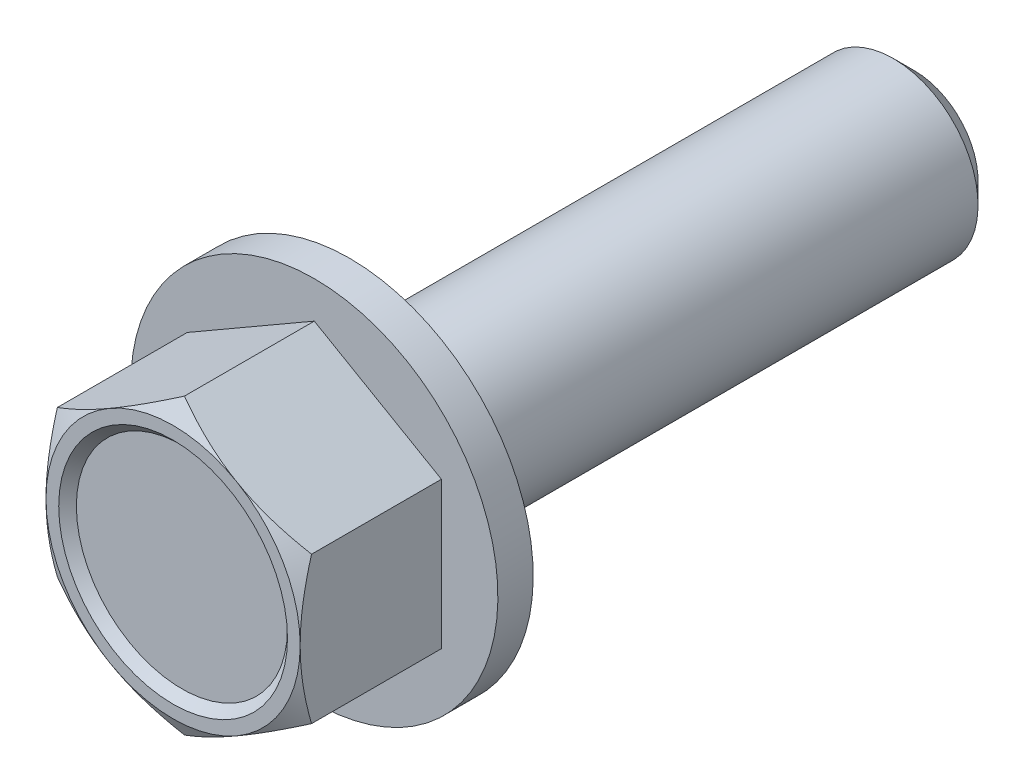
ISO-10303-21;
HEADER;
FILE_DESCRIPTION(('STEP AP214'),'2;1');
FILE_NAME('part.step','',(''),(''),'','','');
FILE_SCHEMA(('AUTOMOTIVE_DESIGN { 1 0 10303 214 1 1 1 1 }'));
ENDSEC;
DATA;
#1=APPLICATION_CONTEXT('core data for automotive mechanical design processes');
#2=APPLICATION_PROTOCOL_DEFINITION('international standard','automotive_design',2000,#1);
#3=PRODUCT_CONTEXT('',#1,'mechanical');
#4=PRODUCT('Part','Part','',(#3));
#5=PRODUCT_RELATED_PRODUCT_CATEGORY('part','',(#4));
#6=PRODUCT_DEFINITION_FORMATION('','',#4);
#7=PRODUCT_DEFINITION_CONTEXT('part definition',#1,'design');
#8=PRODUCT_DEFINITION('design','',#6,#7);
#9=PRODUCT_DEFINITION_SHAPE('','',#8);
#10=(LENGTH_UNIT() NAMED_UNIT(*) SI_UNIT(.MILLI.,.METRE.));
#11=(NAMED_UNIT(*) PLANE_ANGLE_UNIT() SI_UNIT($,.RADIAN.));
#12=(NAMED_UNIT(*) SI_UNIT($,.STERADIAN.) SOLID_ANGLE_UNIT());
#13=UNCERTAINTY_MEASURE_WITH_UNIT(LENGTH_MEASURE(1.E-05),#10,'distance_accuracy_value','');
#14=(GEOMETRIC_REPRESENTATION_CONTEXT(3) GLOBAL_UNCERTAINTY_ASSIGNED_CONTEXT((#13)) GLOBAL_UNIT_ASSIGNED_CONTEXT((#10,
#11,#12)) REPRESENTATION_CONTEXT('',''));
#15=CARTESIAN_POINT('',(0.,0.,0.));
#16=DIRECTION('',(0.,0.,1.));
#17=DIRECTION('',(1.,0.,0.));
#18=AXIS2_PLACEMENT_3D('',#15,#16,#17);
#19=CARTESIAN_POINT('',(7.14375,-4.12444598552339,-29.7620167472272));
#20=DIRECTION('',(1.,0.,0.));
#21=DIRECTION('',(0.,0.,-1.));
#22=AXIS2_PLACEMENT_3D('',#19,#20,#21);
#23=PLANE('',#22);
#24=DIRECTION('',(0.,0.,1.));
#25=VECTOR('',#24,1.);
#26=CARTESIAN_POINT('',(7.14375,4.12444598552339,-29.7620167472272));
#27=LINE('',#26,#25);
#28=CARTESIAN_POINT('',(7.14375,4.12444598552339,-7.9375));
#29=VERTEX_POINT('',#28);
#30=CARTESIAN_POINT('',(7.14375,4.12444598552339,-0.638054014476607));
#31=VERTEX_POINT('',#30);
#32=EDGE_CURVE('E130',#29,#31,#27,.T.);
#33=ORIENTED_EDGE('',*,*,#32,.T.);
#34=CARTESIAN_POINT('',(7.14375,-11.1264821663031,-3.50950819868023));
#35=CARTESIAN_POINT('',(7.14375,-10.8139653368023,-3.35771826747608));
#36=CARTESIAN_POINT('',(7.14375,-10.5007360070904,-3.20737041175011));
#37=CARTESIAN_POINT('',(7.14375,-9.87247341175507,-2.91036930424403));
#38=CARTESIAN_POINT('',(7.14375,-9.55743987513636,-2.76371662635213));
#39=CARTESIAN_POINT('',(7.14375,-8.92359078284582,-2.474189273156));
#40=CARTESIAN_POINT('',(7.14375,-8.60476400473929,-2.33133908243073));
#41=CARTESIAN_POINT('',(7.14375,-7.9645901440533,-2.05142432969127));
#42=CARTESIAN_POINT('',(7.14375,-7.64324318024328,-1.91435949694891));
#43=CARTESIAN_POINT('',(7.14375,-6.98716875317179,-1.6432658754563));
#44=CARTESIAN_POINT('',(7.14375,-6.65234243288806,-1.50947502070524));
#45=CARTESIAN_POINT('',(7.14375,-5.97879168628792,-1.25190405211195));
#46=CARTESIAN_POINT('',(7.14375,-5.64006683029124,-1.12812505404059));
#47=CARTESIAN_POINT('',(7.14375,-4.95879364772962,-0.893791111508422));
#48=CARTESIAN_POINT('',(7.14375,-4.61625446733773,-0.783209860013388));
#49=CARTESIAN_POINT('',(7.14375,-3.92627616557254,-0.578785846429196));
#50=CARTESIAN_POINT('',(7.14375,-3.57883860795286,-0.484937867389285));
#51=CARTESIAN_POINT('',(7.14375,-2.88064126074926,-0.318932739620268));
#52=CARTESIAN_POINT('',(7.14375,-2.5299091116702,-0.246662460359437));
#53=CARTESIAN_POINT('',(7.14375,-2.00058036472825,-0.157568562477359));
#54=CARTESIAN_POINT('',(7.14375,-1.82358702993423,-0.131088053273357));
#55=CARTESIAN_POINT('',(7.14375,-1.46870447103796,-0.0850822824522652));
#56=CARTESIAN_POINT('',(7.14375,-1.29081533532589,-0.0655563477434251));
#57=CARTESIAN_POINT('',(7.14375,-0.936724957060508,-0.0340961976423995));
#58=CARTESIAN_POINT('',(7.14375,-0.760532329416691,-0.0220654101749404));
#59=CARTESIAN_POINT('',(7.14375,-0.40779607194931,-0.00546792409180287));
#60=CARTESIAN_POINT('',(7.14375,-0.231252448081633,-0.000901099887896732));
#61=CARTESIAN_POINT('',(7.14375,0.12187286025024,0.000659376128433967));
#62=CARTESIAN_POINT('',(7.14375,0.298454545369517,-0.00234711490423107));
#63=CARTESIAN_POINT('',(7.14375,0.651332924181608,-0.0158594071837309));
#64=CARTESIAN_POINT('',(7.14375,0.827629603556379,-0.0263655741401726));
#65=CARTESIAN_POINT('',(7.14375,1.24971850742382,-0.0602738892040787));
#66=CARTESIAN_POINT('',(7.14375,1.49523806911308,-0.0871447893509359));
#67=CARTESIAN_POINT('',(7.14375,1.98447603489236,-0.153978286224434));
#68=CARTESIAN_POINT('',(7.14375,2.22819419698766,-0.193942610334252));
#69=CARTESIAN_POINT('',(7.14375,2.95634044363797,-0.331357740941859));
#70=CARTESIAN_POINT('',(7.14375,3.43751087738919,-0.446308001197388));
#71=CARTESIAN_POINT('',(7.14375,4.15738573166842,-0.645993240802331));
#72=CARTESIAN_POINT('',(7.14375,4.39980939898406,-0.718092674680191));
#73=CARTESIAN_POINT('',(7.14375,4.88230108226118,-0.869854806642564));
#74=CARTESIAN_POINT('',(7.14375,5.12236907963036,-0.949517564368237));
#75=CARTESIAN_POINT('',(7.14375,5.60022924677041,-1.11512156257428));
#76=CARTESIAN_POINT('',(7.14375,5.838022075159,-1.20106091983054));
#77=CARTESIAN_POINT('',(7.14375,6.31162708846242,-1.37819916814323));
#78=CARTESIAN_POINT('',(7.14375,6.54743932522735,-1.46939792101867));
#79=CARTESIAN_POINT('',(7.14375,7.21060689121359,-1.73300627722653));
#80=CARTESIAN_POINT('',(7.14375,7.63593909043028,-1.91050165708015));
#81=CARTESIAN_POINT('',(7.14375,8.48205079010073,-2.27606982761281));
#82=CARTESIAN_POINT('',(7.14375,8.90282971121883,-2.4641439458386));
#83=CARTESIAN_POINT('',(7.14375,9.74095528443531,-2.84822478210328));
#84=CARTESIAN_POINT('',(7.14375,10.1583004031092,-3.04423483487427));
#85=CARTESIAN_POINT('',(7.14375,10.990119043083,-3.44218567029594));
#86=CARTESIAN_POINT('',(7.14375,11.4045926986007,-3.64412617340243));
#87=CARTESIAN_POINT('',(7.14375,12.2319781793144,-4.05293368364545));
#88=CARTESIAN_POINT('',(7.14375,12.6448861345917,-4.25980850643417));
#89=CARTESIAN_POINT('',(7.14375,13.4688795641921,-4.67716013739086));
#90=CARTESIAN_POINT('',(7.14375,13.8799650206843,-4.88763698070255));
#91=CARTESIAN_POINT('',(7.14375,14.7005537912386,-5.31140419160651));
#92=CARTESIAN_POINT('',(7.14375,15.1100574684663,-5.52469385679481));
#93=CARTESIAN_POINT('',(7.14375,15.9278504770156,-5.95358989401135));
#94=CARTESIAN_POINT('',(7.14375,16.336139803814,-6.16919627465487));
#95=CARTESIAN_POINT('',(7.14375,17.4673654734861,-6.76991129623756));
#96=CARTESIAN_POINT('',(7.14375,18.1892275289669,-7.15704244957695));
#97=CARTESIAN_POINT('',(7.14375,19.6306995163026,-7.93558465303761));
#98=CARTESIAN_POINT('',(7.14375,20.3503092889636,-8.32699599727653));
#99=CARTESIAN_POINT('',(7.14375,21.7853245591529,-9.11162065020448));
#100=CARTESIAN_POINT('',(7.14375,22.5007359991666,-9.50482310050648));
#101=CARTESIAN_POINT('',(7.14375,23.9301561649418,-10.2936282558331));
#102=CARTESIAN_POINT('',(7.14375,24.6441650039799,-10.6892307555066));
#103=CARTESIAN_POINT('',(7.14375,25.3576892382085,-11.0856993958117));
#104=B_SPLINE_CURVE_WITH_KNOTS('',3,(#34,#35,#36,#37,#38,#39,#40,#41,#42,#43,#44,#45,#46,#47,
#48,#49,#50,#51,#52,#53,#54,#55,#56,#57,#58,#59,#60,#61,#62,#63,#64,#65,#66,#67,#68,#69,#70,#71,
#72,#73,#74,#75,#76,#77,#78,#79,#80,#81,#82,#83,#84,#85,#86,#87,#88,#89,#90,#91,#92,#93,#94,#95,
#96,#97,#98,#99,#100,#101,#102,#103),.UNSPECIFIED.,.F.,.F.,(4,2,2,2,2,2,2,2,2,2,2,2,2,2,2,2,2,2,
2,2,2,2,2,2,2,2,2,2,2,2,2,2,2,2,4),(0.,1.04229969233251,2.08476027593951,3.13281258100468,
4.18081578754023,5.26239290728166,6.3440903977295,7.42359439869354,8.50276125076479,
9.57616651875342,10.1129412764756,10.6496640688472,11.1793200509066,11.7089671209124,
12.2386241810014,12.7683070707276,13.5088470408505,14.2494847479548,15.7315081130324,
16.4901976432922,17.2488931567523,18.0073619598736,18.7658108446853,20.1482340384663,
21.5308311040017,22.9140153015761,24.2971344041878,25.6826127069184,27.0681045350172,
28.4532567007071,29.8384140192124,32.2957474327006,34.7532507789114,37.2022851094377,
39.6511127726329),.UNSPECIFIED.);
#105=CARTESIAN_POINT('',(7.14375,0.,0.));
#106=VERTEX_POINT('',#105);
#107=EDGE_CURVE('E56',#31,#106,#104,.F.);
#108=ORIENTED_EDGE('',*,*,#107,.T.);
#109=CARTESIAN_POINT('',(7.14375,-4.12444598552339,-0.638054014476607));
#110=VERTEX_POINT('',#109);
#111=EDGE_CURVE('E103',#106,#110,#104,.F.);
#112=ORIENTED_EDGE('',*,*,#111,.T.);
#113=DIRECTION('',(0.,0.,1.));
#114=VECTOR('',#113,1.);
#115=CARTESIAN_POINT('',(7.14375,-4.12444598552339,-29.7620167472272));
#116=LINE('',#115,#114);
#117=CARTESIAN_POINT('',(7.14375,-4.12444598552339,-7.9375));
#118=VERTEX_POINT('',#117);
#119=EDGE_CURVE('E148',#118,#110,#116,.T.);
#120=ORIENTED_EDGE('',*,*,#119,.F.);
#121=DIRECTION('',(0.,1.,0.));
#122=VECTOR('',#121,1.);
#123=CARTESIAN_POINT('',(7.14375,7.14375,-7.9375));
#124=LINE('',#123,#122);
#125=EDGE_CURVE('E200',#118,#29,#124,.T.);
#126=ORIENTED_EDGE('',*,*,#125,.T.);
#127=EDGE_LOOP('',(#33,#108,#112,#120,#126));
#128=FACE_BOUND('',#127,.T.);
#129=ADVANCED_FACE('F33',(#128),#23,.T.);
#130=CARTESIAN_POINT('',(0.,-8.24889197104677,-29.7620167472272));
#131=DIRECTION('',(0.5,-0.866025403784439,0.));
#132=DIRECTION('',(0.866025403784439,0.5,0.));
#133=AXIS2_PLACEMENT_3D('',#130,#131,#132);
#134=PLANE('',#133);
#135=ORIENTED_EDGE('',*,*,#119,.T.);
#136=CARTESIAN_POINT('',(7.14394999999999,-4.12433051546955,-0.638120682543079));
#137=CARTESIAN_POINT('',(6.9869223439891,-4.21499047493765,-0.585786031450028));
#138=CARTESIAN_POINT('',(6.82930921296503,-4.30598845856222,-0.535826525859227));
#139=CARTESIAN_POINT('',(6.51280296382357,-4.48872342670424,-0.4413119675316));
#140=CARTESIAN_POINT('',(6.35390932482101,-4.58046071195489,-0.396759246202068));
#141=CARTESIAN_POINT('',(5.8746843311865,-4.85714139103217,-0.272085762111171));
#142=CARTESIAN_POINT('',(5.55246131541769,-5.04317693592539,-0.20117290995575));
#143=CARTESIAN_POINT('',(5.07026043670648,-5.32157574305278,-0.11801923859694));
#144=CARTESIAN_POINT('',(4.91172333175978,-5.4131071832703,-0.0943311655565162));
#145=CARTESIAN_POINT('',(4.59393278025988,-5.59658364372468,-0.0546097231355157));
#146=CARTESIAN_POINT('',(4.43467939825459,-5.6885286266948,-0.0385756774244521));
#147=CARTESIAN_POINT('',(4.11589604883692,-5.87257827929426,-0.0145709220089873));
#148=CARTESIAN_POINT('',(3.95636660206697,-5.96468264833056,-0.00659106141370785));
#149=CARTESIAN_POINT('',(3.63716915531883,-6.14897138013524,0.00114277570775409));
#150=CARTESIAN_POINT('',(3.47750115977337,-6.24115574034438,0.000897006357257756));
#151=CARTESIAN_POINT('',(3.04006423550959,-6.49371006632156,-0.0110829103911831));
#152=CARTESIAN_POINT('',(2.76243850332942,-6.65399735752974,-0.0311936211450384));
#153=CARTESIAN_POINT('',(2.20903100338617,-6.97350732659354,-0.0949645067430005));
#154=CARTESIAN_POINT('',(1.93325118182535,-7.13272888080874,-0.138646477465762));
#155=CARTESIAN_POINT('',(1.37872997818721,-7.45288184700058,-0.247838590456745));
#156=CARTESIAN_POINT('',(1.10005856515092,-7.61377286233254,-0.313811361888179));
#157=CARTESIAN_POINT('',(0.546871483354955,-7.93315557291966,-0.463542882158135));
#158=CARTESIAN_POINT('',(0.27234873026381,-8.09165135831551,-0.54726646037564));
#159=CARTESIAN_POINT('',(-0.000200000000002058,-8.24900744110061,-0.638120682543078));
#160=B_SPLINE_CURVE_WITH_KNOTS('',3,(#136,#137,#138,#139,#140,#141,#142,#143,#144,#145,#146,
#147,#148,#149,#150,#151,#152,#153,#154,#155,#156,#157,#158,#159),.UNSPECIFIED.,.F.,.F.,(4,2,2,
2,2,2,2,2,2,2,2,4),(0.,0.566119481838005,1.13248221371019,2.2675610579816,2.82119915823017,
3.37478832846408,3.92774781910558,4.48069022658465,5.44329448766884,6.4067903790172,
7.39165514483023,8.37458648302853),.UNSPECIFIED.);
#161=CARTESIAN_POINT('',(3.571875,-6.18666897828508,0.));
#162=VERTEX_POINT('',#161);
#163=EDGE_CURVE('E106',#110,#162,#160,.T.);
#164=ORIENTED_EDGE('',*,*,#163,.T.);
#165=CARTESIAN_POINT('',(0.,-8.24889197104677,-0.638054014476607));
#166=VERTEX_POINT('',#165);
#167=EDGE_CURVE('E141',#162,#166,#160,.T.);
#168=ORIENTED_EDGE('',*,*,#167,.T.);
#169=DIRECTION('',(0.,0.,1.));
#170=VECTOR('',#169,1.);
#171=CARTESIAN_POINT('',(0.,-8.24889197104677,-29.7620167472272));
#172=LINE('',#171,#170);
#173=CARTESIAN_POINT('',(0.,-8.24889197104677,-7.9375));
#174=VERTEX_POINT('',#173);
#175=EDGE_CURVE('E222',#174,#166,#172,.T.);
#176=ORIENTED_EDGE('',*,*,#175,.F.);
#177=DIRECTION('',(0.866025403784439,0.5,0.));
#178=VECTOR('',#177,1.);
#179=CARTESIAN_POINT('',(6.66520948914253,-4.40073147828508,-7.9375));
#180=LINE('',#179,#178);
#181=EDGE_CURVE('E196',#174,#118,#180,.T.);
#182=ORIENTED_EDGE('',*,*,#181,.T.);
#183=EDGE_LOOP('',(#135,#164,#168,#176,#182));
#184=FACE_BOUND('',#183,.T.);
#185=ADVANCED_FACE('F157',(#184),#134,.T.);
#186=CARTESIAN_POINT('',(-7.14375,-4.12444598552339,-29.7620167472272));
#187=DIRECTION('',(-0.5,-0.866025403784439,0.));
#188=DIRECTION('',(0.866025403784439,-0.5,0.));
#189=AXIS2_PLACEMENT_3D('',#186,#187,#188);
#190=PLANE('',#189);
#191=ORIENTED_EDGE('',*,*,#175,.T.);
#192=CARTESIAN_POINT('',(0.000199999999998265,-8.24900744110061,-0.638120682543079));
#193=CARTESIAN_POINT('',(-0.156827656010894,-8.15834748163251,-0.585786031450028));
#194=CARTESIAN_POINT('',(-0.314440787034967,-8.06734949800794,-0.535826525859227));
#195=CARTESIAN_POINT('',(-0.630947036176426,-7.88461452986592,-0.4413119675316));
#196=CARTESIAN_POINT('',(-0.789840675178984,-7.79287724461527,-0.396759246202068));
#197=CARTESIAN_POINT('',(-1.26906566881349,-7.51619656553799,-0.272085762111171));
#198=CARTESIAN_POINT('',(-1.59128868458231,-7.33016102064477,-0.20117290995575));
#199=CARTESIAN_POINT('',(-2.07348956329352,-7.05176221351738,-0.11801923859694));
#200=CARTESIAN_POINT('',(-2.23202666824022,-6.96023077329986,-0.0943311655565166));
#201=CARTESIAN_POINT('',(-2.54981721974012,-6.77675431284547,-0.0546097231355163));
#202=CARTESIAN_POINT('',(-2.70907060174541,-6.68480932987536,-0.0385756774244523));
#203=CARTESIAN_POINT('',(-3.02785395116308,-6.5007596772759,-0.0145709220089875));
#204=CARTESIAN_POINT('',(-3.18738339793303,-6.40865530823959,-0.00659106141370858));
#205=CARTESIAN_POINT('',(-3.50658084468117,-6.22436657643491,0.00114277570775281));
#206=CARTESIAN_POINT('',(-3.66624884022663,-6.13218221622578,0.000897006357256417));
#207=CARTESIAN_POINT('',(-4.10368576449041,-5.8796278902486,-0.0110829103911845));
#208=CARTESIAN_POINT('',(-4.38131149667057,-5.71934059904042,-0.0311936211450398));
#209=CARTESIAN_POINT('',(-4.93471899661383,-5.39983062997662,-0.094964506743002));
#210=CARTESIAN_POINT('',(-5.21049881817465,-5.24060907576141,-0.138646477465764));
#211=CARTESIAN_POINT('',(-5.76502002181279,-4.92045610956958,-0.247838590456747));
#212=CARTESIAN_POINT('',(-6.04369143484908,-4.75956509423762,-0.313811361888181));
#213=CARTESIAN_POINT('',(-6.59687851664504,-4.4401823836505,-0.463542882158136));
#214=CARTESIAN_POINT('',(-6.87140126973619,-4.28168659825465,-0.547266460375642));
#215=CARTESIAN_POINT('',(-7.14395,-4.12433051546955,-0.638120682543079));
#216=B_SPLINE_CURVE_WITH_KNOTS('',3,(#192,#193,#194,#195,#196,#197,#198,#199,#200,#201,#202,
#203,#204,#205,#206,#207,#208,#209,#210,#211,#212,#213,#214,#215),.UNSPECIFIED.,.F.,.F.,(4,2,2,
2,2,2,2,2,2,2,2,4),(0.,0.566119481838005,1.13248221371019,2.2675610579816,2.82119915823017,
3.37478832846408,3.92774781910558,4.48069022658465,5.44329448766884,6.40679037901719,
7.39165514483023,8.37458648302853),.UNSPECIFIED.);
#217=CARTESIAN_POINT('',(-3.571875,-6.18666897828508,0.));
#218=VERTEX_POINT('',#217);
#219=EDGE_CURVE('E277',#166,#218,#216,.T.);
#220=ORIENTED_EDGE('',*,*,#219,.T.);
#221=CARTESIAN_POINT('',(-7.14375,-4.12444598552339,-0.638054014476607));
#222=VERTEX_POINT('',#221);
#223=EDGE_CURVE('E271',#218,#222,#216,.T.);
#224=ORIENTED_EDGE('',*,*,#223,.T.);
#225=DIRECTION('',(0.,0.,1.));
#226=VECTOR('',#225,1.);
#227=CARTESIAN_POINT('',(-7.14375,-4.12444598552339,-29.7620167472272));
#228=LINE('',#227,#226);
#229=CARTESIAN_POINT('',(-7.14375,-4.12444598552339,-7.9375));
#230=VERTEX_POINT('',#229);
#231=EDGE_CURVE('E220',#230,#222,#228,.T.);
#232=ORIENTED_EDGE('',*,*,#231,.F.);
#233=DIRECTION('',(0.866025403784439,-0.5,0.));
#234=VECTOR('',#233,1.);
#235=CARTESIAN_POINT('',(-6.66520948914254,-4.40073147828508,-7.9375));
#236=LINE('',#235,#234);
#237=EDGE_CURVE('E194',#230,#174,#236,.T.);
#238=ORIENTED_EDGE('',*,*,#237,.T.);
#239=EDGE_LOOP('',(#191,#220,#224,#232,#238));
#240=FACE_BOUND('',#239,.T.);
#241=ADVANCED_FACE('F266',(#240),#190,.T.);
#242=CARTESIAN_POINT('',(-7.14375,4.12444598552339,-29.7620167472272));
#243=DIRECTION('',(-1.,0.,0.));
#244=DIRECTION('',(0.,0.,1.));
#245=AXIS2_PLACEMENT_3D('',#242,#243,#244);
#246=PLANE('',#245);
#247=ORIENTED_EDGE('',*,*,#231,.T.);
#248=CARTESIAN_POINT('',(-7.14375,-11.1264821663031,-3.50950819868023));
#249=CARTESIAN_POINT('',(-7.14375,-10.8139653368023,-3.35771826747608));
#250=CARTESIAN_POINT('',(-7.14375,-10.5007360070904,-3.20737041175011));
#251=CARTESIAN_POINT('',(-7.14375,-9.87247341175507,-2.91036930424403));
#252=CARTESIAN_POINT('',(-7.14375,-9.55743987513636,-2.76371662635213));
#253=CARTESIAN_POINT('',(-7.14375,-8.92359078284582,-2.474189273156));
#254=CARTESIAN_POINT('',(-7.14375,-8.60476400473929,-2.33133908243073));
#255=CARTESIAN_POINT('',(-7.14375,-7.9645901440533,-2.05142432969127));
#256=CARTESIAN_POINT('',(-7.14375,-7.64324318024328,-1.91435949694891));
#257=CARTESIAN_POINT('',(-7.14375,-6.98716875317179,-1.6432658754563));
#258=CARTESIAN_POINT('',(-7.14375,-6.65234243288806,-1.50947502070524));
#259=CARTESIAN_POINT('',(-7.14375,-5.97879168628792,-1.25190405211195));
#260=CARTESIAN_POINT('',(-7.14375,-5.64006683029124,-1.12812505404059));
#261=CARTESIAN_POINT('',(-7.14375,-4.95879364772963,-0.893791111508423));
#262=CARTESIAN_POINT('',(-7.14375,-4.61625446733773,-0.78320986001339));
#263=CARTESIAN_POINT('',(-7.14375,-3.92627616557254,-0.578785846429197));
#264=CARTESIAN_POINT('',(-7.14375,-3.57883860795286,-0.484937867389285));
#265=CARTESIAN_POINT('',(-7.14375,-2.88064126074927,-0.318932739620268));
#266=CARTESIAN_POINT('',(-7.14375,-2.5299091116702,-0.246662460359438));
#267=CARTESIAN_POINT('',(-7.14375,-2.00058036472826,-0.15756856247736));
#268=CARTESIAN_POINT('',(-7.14375,-1.82358702993423,-0.131088053273357));
#269=CARTESIAN_POINT('',(-7.14375,-1.46870447103796,-0.0850822824522651));
#270=CARTESIAN_POINT('',(-7.14375,-1.29081533532589,-0.065556347743425));
#271=CARTESIAN_POINT('',(-7.14375,-0.936724957060509,-0.0340961976423996));
#272=CARTESIAN_POINT('',(-7.14375,-0.760532329416693,-0.0220654101749404));
#273=CARTESIAN_POINT('',(-7.14375,-0.407796071949312,-0.00546792409180285));
#274=CARTESIAN_POINT('',(-7.14375,-0.231252448081635,-0.000901099887896727));
#275=CARTESIAN_POINT('',(-7.14375,0.121872860250238,0.000659376128433963));
#276=CARTESIAN_POINT('',(-7.14375,0.298454545369516,-0.00234711490423107));
#277=CARTESIAN_POINT('',(-7.14375,0.651332924181607,-0.0158594071837309));
#278=CARTESIAN_POINT('',(-7.14375,0.827629603556378,-0.0263655741401726));
#279=CARTESIAN_POINT('',(-7.14375,1.24971850742382,-0.0602738892040787));
#280=CARTESIAN_POINT('',(-7.14375,1.49523806911308,-0.0871447893509358));
#281=CARTESIAN_POINT('',(-7.14375,1.98447603489236,-0.153978286224434));
#282=CARTESIAN_POINT('',(-7.14375,2.22819419698766,-0.193942610334252));
#283=CARTESIAN_POINT('',(-7.14375,2.95634044363797,-0.331357740941858));
#284=CARTESIAN_POINT('',(-7.14375,3.43751087738919,-0.446308001197387));
#285=CARTESIAN_POINT('',(-7.14375,4.15738573166842,-0.64599324080233));
#286=CARTESIAN_POINT('',(-7.14375,4.39980939898406,-0.71809267468019));
#287=CARTESIAN_POINT('',(-7.14375,4.88230108226117,-0.869854806642564));
#288=CARTESIAN_POINT('',(-7.14375,5.12236907963036,-0.949517564368237));
#289=CARTESIAN_POINT('',(-7.14375,5.60022924677041,-1.11512156257427));
#290=CARTESIAN_POINT('',(-7.14375,5.838022075159,-1.20106091983053));
#291=CARTESIAN_POINT('',(-7.14375,6.31162708846242,-1.37819916814323));
#292=CARTESIAN_POINT('',(-7.14375,6.54743932522735,-1.46939792101867));
#293=CARTESIAN_POINT('',(-7.14375,7.21060689121359,-1.73300627722653));
#294=CARTESIAN_POINT('',(-7.14375,7.63593909043029,-1.91050165708015));
#295=CARTESIAN_POINT('',(-7.14375,8.48205079010074,-2.27606982761281));
#296=CARTESIAN_POINT('',(-7.14375,8.90282971121883,-2.46414394583861));
#297=CARTESIAN_POINT('',(-7.14375,9.74095528443531,-2.84822478210328));
#298=CARTESIAN_POINT('',(-7.14375,10.1583004031092,-3.04423483487427));
#299=CARTESIAN_POINT('',(-7.14375,10.990119043083,-3.44218567029594));
#300=CARTESIAN_POINT('',(-7.14375,11.4045926986007,-3.64412617340243));
#301=CARTESIAN_POINT('',(-7.14375,12.2319781793144,-4.05293368364545));
#302=CARTESIAN_POINT('',(-7.14375,12.6448861345918,-4.25980850643417));
#303=CARTESIAN_POINT('',(-7.14375,13.4688795641921,-4.67716013739087));
#304=CARTESIAN_POINT('',(-7.14375,13.8799650206843,-4.88763698070256));
#305=CARTESIAN_POINT('',(-7.14375,14.7005537912386,-5.31140419160651));
#306=CARTESIAN_POINT('',(-7.14375,15.1100574684663,-5.52469385679481));
#307=CARTESIAN_POINT('',(-7.14375,15.9278504770156,-5.95358989401136));
#308=CARTESIAN_POINT('',(-7.14375,16.3361398038141,-6.16919627465488));
#309=CARTESIAN_POINT('',(-7.14375,17.4673654734861,-6.76991129623757));
#310=CARTESIAN_POINT('',(-7.14375,18.1892275289669,-7.15704244957696));
#311=CARTESIAN_POINT('',(-7.14375,19.6306995163026,-7.93558465303761));
#312=CARTESIAN_POINT('',(-7.14375,20.3503092889636,-8.32699599727653));
#313=CARTESIAN_POINT('',(-7.14375,21.7853245591529,-9.11162065020448));
#314=CARTESIAN_POINT('',(-7.14375,22.5007359991666,-9.50482310050648));
#315=CARTESIAN_POINT('',(-7.14375,23.9301561649418,-10.2936282558331));
#316=CARTESIAN_POINT('',(-7.14375,24.6441650039799,-10.6892307555066));
#317=CARTESIAN_POINT('',(-7.14375,25.3576892382085,-11.0856993958117));
#318=B_SPLINE_CURVE_WITH_KNOTS('',3,(#248,#249,#250,#251,#252,#253,#254,#255,#256,#257,#258,
#259,#260,#261,#262,#263,#264,#265,#266,#267,#268,#269,#270,#271,#272,#273,#274,#275,#276,#277,
#278,#279,#280,#281,#282,#283,#284,#285,#286,#287,#288,#289,#290,#291,#292,#293,#294,#295,#296,
#297,#298,#299,#300,#301,#302,#303,#304,#305,#306,#307,#308,#309,#310,#311,#312,#313,#314,#315,
#316,#317),.UNSPECIFIED.,.F.,.F.,(4,2,2,2,2,2,2,2,2,2,2,2,2,2,2,2,2,2,2,2,2,2,2,2,2,2,2,2,2,2,2,
2,2,2,4),(0.,1.04229969233251,2.08476027593951,3.13281258100468,4.18081578754023,
5.26239290728166,6.3440903977295,7.42359439869354,8.50276125076479,9.57616651875342,
10.1129412764756,10.6496640688472,11.1793200509066,11.7089671209124,12.2386241810014,
12.7683070707276,13.5088470408505,14.2494847479548,15.7315081130324,16.4901976432922,
17.2488931567523,18.0073619598736,18.7658108446853,20.1482340384663,21.5308311040017,
22.9140153015761,24.2971344041878,25.6826127069184,27.0681045350173,28.4532567007071,
29.8384140192124,32.2957474327006,34.7532507789114,37.2022851094377,39.6511127726329),.UNSPECIFIED.);
#319=CARTESIAN_POINT('',(-7.14375,0.,0.));
#320=VERTEX_POINT('',#319);
#321=EDGE_CURVE('E278',#222,#320,#318,.T.);
#322=ORIENTED_EDGE('',*,*,#321,.T.);
#323=CARTESIAN_POINT('',(-7.14375,4.12444598552339,-0.638054014476607));
#324=VERTEX_POINT('',#323);
#325=EDGE_CURVE('E253',#320,#324,#318,.T.);
#326=ORIENTED_EDGE('',*,*,#325,.T.);
#327=DIRECTION('',(0.,0.,1.));
#328=VECTOR('',#327,1.);
#329=CARTESIAN_POINT('',(-7.14375,4.12444598552339,-29.7620167472272));
#330=LINE('',#329,#328);
#331=CARTESIAN_POINT('',(-7.14375,4.12444598552339,-7.9375));
#332=VERTEX_POINT('',#331);
#333=EDGE_CURVE('E217',#332,#324,#330,.T.);
#334=ORIENTED_EDGE('',*,*,#333,.F.);
#335=DIRECTION('',(0.,-1.,0.));
#336=VECTOR('',#335,1.);
#337=CARTESIAN_POINT('',(-7.14375,7.14375,-7.9375));
#338=LINE('',#337,#336);
#339=EDGE_CURVE('E198',#332,#230,#338,.T.);
#340=ORIENTED_EDGE('',*,*,#339,.T.);
#341=EDGE_LOOP('',(#247,#322,#326,#334,#340));
#342=FACE_BOUND('',#341,.T.);
#343=ADVANCED_FACE('F261',(#342),#246,.T.);
#344=CARTESIAN_POINT('',(0.,8.24889197104677,-29.7620167472272));
#345=DIRECTION('',(-0.5,0.866025403784439,0.));
#346=DIRECTION('',(-0.866025403784439,-0.5,0.));
#347=AXIS2_PLACEMENT_3D('',#344,#345,#346);
#348=PLANE('',#347);
#349=ORIENTED_EDGE('',*,*,#333,.T.);
#350=CARTESIAN_POINT('',(-7.14394999999999,4.12433051546955,-0.638120682543079));
#351=CARTESIAN_POINT('',(-6.9869223439891,4.21499047493766,-0.585786031450028));
#352=CARTESIAN_POINT('',(-6.82930921296503,4.30598845856222,-0.535826525859227));
#353=CARTESIAN_POINT('',(-6.51280296382357,4.48872342670424,-0.441311967531601));
#354=CARTESIAN_POINT('',(-6.35390932482101,4.58046071195489,-0.396759246202068));
#355=CARTESIAN_POINT('',(-5.8746843311865,4.85714139103217,-0.272085762111171));
#356=CARTESIAN_POINT('',(-5.55246131541769,5.04317693592539,-0.20117290995575));
#357=CARTESIAN_POINT('',(-5.07026043670648,5.32157574305278,-0.11801923859694));
#358=CARTESIAN_POINT('',(-4.91172333175977,5.4131071832703,-0.0943311655565166));
#359=CARTESIAN_POINT('',(-4.59393278025988,5.59658364372469,-0.0546097231355163));
#360=CARTESIAN_POINT('',(-4.43467939825459,5.6885286266948,-0.0385756774244528));
#361=CARTESIAN_POINT('',(-4.11589604883692,5.87257827929426,-0.014570922008988));
#362=CARTESIAN_POINT('',(-3.95636660206697,5.96468264833057,-0.00659106141370855));
#363=CARTESIAN_POINT('',(-3.63716915531883,6.14897138013525,0.00114277570775329));
#364=CARTESIAN_POINT('',(-3.47750115977337,6.24115574034438,0.00089700635725684));
#365=CARTESIAN_POINT('',(-3.04006423550959,6.49371006632156,-0.0110829103911842));
#366=CARTESIAN_POINT('',(-2.76243850332942,6.65399735752974,-0.0311936211450396));
#367=CARTESIAN_POINT('',(-2.20903100338617,6.97350732659354,-0.0949645067430017));
#368=CARTESIAN_POINT('',(-1.93325118182535,7.13272888080875,-0.138646477465763));
#369=CARTESIAN_POINT('',(-1.37872997818721,7.45288184700058,-0.247838590456746));
#370=CARTESIAN_POINT('',(-1.10005856515092,7.61377286233254,-0.31381136188818));
#371=CARTESIAN_POINT('',(-0.546871483354957,7.93315557291966,-0.463542882158135));
#372=CARTESIAN_POINT('',(-0.272348730263813,8.09165135831551,-0.54726646037564));
#373=CARTESIAN_POINT('',(0.000199999999998734,8.24900744110061,-0.638120682543078));
#374=B_SPLINE_CURVE_WITH_KNOTS('',3,(#350,#351,#352,#353,#354,#355,#356,#357,#358,#359,#360,
#361,#362,#363,#364,#365,#366,#367,#368,#369,#370,#371,#372,#373),.UNSPECIFIED.,.F.,.F.,(4,2,2,
2,2,2,2,2,2,2,2,4),(0.,0.566119481838007,1.13248221371019,2.2675610579816,2.82119915823017,
3.37478832846408,3.92774781910558,4.48069022658465,5.44329448766884,6.40679037901719,
7.39165514483023,8.37458648302853),.UNSPECIFIED.);
#375=CARTESIAN_POINT('',(-3.571875,6.18666897828508,0.));
#376=VERTEX_POINT('',#375);
#377=EDGE_CURVE('E252',#324,#376,#374,.T.);
#378=ORIENTED_EDGE('',*,*,#377,.T.);
#379=CARTESIAN_POINT('',(0.,8.24889197104677,-0.638054014476606));
#380=VERTEX_POINT('',#379);
#381=EDGE_CURVE('E239',#376,#380,#374,.T.);
#382=ORIENTED_EDGE('',*,*,#381,.T.);
#383=DIRECTION('',(0.,0.,1.));
#384=VECTOR('',#383,1.);
#385=CARTESIAN_POINT('',(0.,8.24889197104677,-29.7620167472272));
#386=LINE('',#385,#384);
#387=CARTESIAN_POINT('',(0.,8.24889197104677,-7.9375));
#388=VERTEX_POINT('',#387);
#389=EDGE_CURVE('E131',#388,#380,#386,.T.);
#390=ORIENTED_EDGE('',*,*,#389,.F.);
#391=DIRECTION('',(-0.866025403784439,-0.5,0.));
#392=VECTOR('',#391,1.);
#393=CARTESIAN_POINT('',(-0.478540510857458,7.97260647828508,-7.9375));
#394=LINE('',#393,#392);
#395=EDGE_CURVE('E202',#388,#332,#394,.T.);
#396=ORIENTED_EDGE('',*,*,#395,.T.);
#397=EDGE_LOOP('',(#349,#378,#382,#390,#396));
#398=FACE_BOUND('',#397,.T.);
#399=ADVANCED_FACE('F187',(#398),#348,.T.);
#400=CARTESIAN_POINT('',(7.14375,4.12444598552339,-29.7620167472272));
#401=DIRECTION('',(0.5,0.866025403784439,0.));
#402=DIRECTION('',(-0.866025403784439,0.5,0.));
#403=AXIS2_PLACEMENT_3D('',#400,#401,#402);
#404=PLANE('',#403);
#405=ORIENTED_EDGE('',*,*,#389,.T.);
#406=CARTESIAN_POINT('',(-0.000200000000001402,8.24900744110061,-0.638120682543078));
#407=CARTESIAN_POINT('',(0.156827656010892,8.1583474816325,-0.585786031450027));
#408=CARTESIAN_POINT('',(0.314440787034964,8.06734949800794,-0.535826525859226));
#409=CARTESIAN_POINT('',(0.630947036176423,7.88461452986592,-0.4413119675316));
#410=CARTESIAN_POINT('',(0.78984067517898,7.79287724461527,-0.396759246202067));
#411=CARTESIAN_POINT('',(1.26906566881349,7.51619656553799,-0.272085762111169));
#412=CARTESIAN_POINT('',(1.59128868458231,7.33016102064477,-0.201172909955749));
#413=CARTESIAN_POINT('',(2.07348956329352,7.05176221351738,-0.118019238596939));
#414=CARTESIAN_POINT('',(2.23202666824022,6.96023077329986,-0.0943311655565159));
#415=CARTESIAN_POINT('',(2.54981721974011,6.77675431284547,-0.0546097231355155));
#416=CARTESIAN_POINT('',(2.7090706017454,6.68480932987536,-0.0385756774244517));
#417=CARTESIAN_POINT('',(3.02785395116307,6.5007596772759,-0.0145709220089871));
#418=CARTESIAN_POINT('',(3.18738339793303,6.40865530823959,-0.00659106141370814));
#419=CARTESIAN_POINT('',(3.50658084468117,6.22436657643492,0.00114277570775365));
#420=CARTESIAN_POINT('',(3.66624884022662,6.13218221622578,0.000897006357257576));
#421=CARTESIAN_POINT('',(4.1036857644904,5.8796278902486,-0.0110829103911831));
#422=CARTESIAN_POINT('',(4.38131149667057,5.71934059904042,-0.0311936211450389));
#423=CARTESIAN_POINT('',(4.93471899661382,5.39983062997662,-0.0949645067430013));
#424=CARTESIAN_POINT('',(5.21049881817465,5.24060907576141,-0.138646477465763));
#425=CARTESIAN_POINT('',(5.76502002181278,4.92045610956958,-0.247838590456746));
#426=CARTESIAN_POINT('',(6.04369143484908,4.75956509423762,-0.31381136188818));
#427=CARTESIAN_POINT('',(6.59687851664504,4.4401823836505,-0.463542882158135));
#428=CARTESIAN_POINT('',(6.87140126973618,4.28168659825465,-0.547266460375641));
#429=CARTESIAN_POINT('',(7.14394999999999,4.12433051546955,-0.638120682543079));
#430=B_SPLINE_CURVE_WITH_KNOTS('',3,(#406,#407,#408,#409,#410,#411,#412,#413,#414,#415,#416,
#417,#418,#419,#420,#421,#422,#423,#424,#425,#426,#427,#428,#429),.UNSPECIFIED.,.F.,.F.,(4,2,2,
2,2,2,2,2,2,2,2,4),(0.,0.566119481838006,1.13248221371019,2.2675610579816,2.82119915823017,
3.37478832846407,3.92774781910558,4.48069022658464,5.44329448766884,6.40679037901719,
7.39165514483023,8.37458648302853),.UNSPECIFIED.);
#431=CARTESIAN_POINT('',(3.571875,6.18666897828508,0.));
#432=VERTEX_POINT('',#431);
#433=EDGE_CURVE('E237',#380,#432,#430,.T.);
#434=ORIENTED_EDGE('',*,*,#433,.T.);
#435=EDGE_CURVE('E114',#432,#31,#430,.T.);
#436=ORIENTED_EDGE('',*,*,#435,.T.);
#437=ORIENTED_EDGE('',*,*,#32,.F.);
#438=DIRECTION('',(-0.866025403784439,0.5,0.));
#439=VECTOR('',#438,1.);
#440=CARTESIAN_POINT('',(0.478540510857457,7.97260647828508,-7.9375));
#441=LINE('',#440,#439);
#442=EDGE_CURVE('E204',#29,#388,#441,.T.);
#443=ORIENTED_EDGE('',*,*,#442,.T.);
#444=EDGE_LOOP('',(#405,#434,#436,#437,#443));
#445=FACE_BOUND('',#444,.T.);
#446=ADVANCED_FACE('F158',(#445),#404,.T.);
#447=CARTESIAN_POINT('',(0.,4.7625,-41.671875));
#448=DIRECTION('',(0.,0.,-1.));
#449=DIRECTION('',(0.,1.,0.));
#450=AXIS2_PLACEMENT_3D('',#447,#448,#449);
#451=PLANE('',#450);
#452=CARTESIAN_POINT('',(0.,0.,-41.671875));
#453=DIRECTION('',(0.,0.,-1.));
#454=DIRECTION('',(0.,1.,0.));
#455=AXIS2_PLACEMENT_3D('',#452,#453,#454);
#456=CIRCLE('',#455,3.571875);
#457=CARTESIAN_POINT('',(0.,3.571875,-41.671875));
#458=VERTEX_POINT('',#457);
#459=EDGE_CURVE('E41',#458,#458,#456,.T.);
#460=ORIENTED_EDGE('',*,*,#459,.T.);
#461=EDGE_LOOP('',(#460));
#462=FACE_BOUND('',#461,.T.);
#463=ADVANCED_FACE('F177',(#462),#451,.T.);
#464=CARTESIAN_POINT('',(0.,7.14375,-7.9375));
#465=DIRECTION('',(0.,0.,1.));
#466=DIRECTION('',(0.,-1.,0.));
#467=AXIS2_PLACEMENT_3D('',#464,#465,#466);
#468=PLANE('',#467);
#469=ORIENTED_EDGE('',*,*,#237,.F.);
#470=ORIENTED_EDGE('',*,*,#339,.F.);
#471=ORIENTED_EDGE('',*,*,#395,.F.);
#472=ORIENTED_EDGE('',*,*,#442,.F.);
#473=ORIENTED_EDGE('',*,*,#125,.F.);
#474=ORIENTED_EDGE('',*,*,#181,.F.);
#475=EDGE_LOOP('',(#469,#470,#471,#472,#473,#474));
#476=FACE_BOUND('',#475,.T.);
#477=CARTESIAN_POINT('',(0.,0.,-7.9375));
#478=DIRECTION('',(0.,0.,-1.));
#479=DIRECTION('',(0.,1.,0.));
#480=AXIS2_PLACEMENT_3D('',#477,#478,#479);
#481=CIRCLE('',#480,10.31875);
#482=CARTESIAN_POINT('',(0.,10.31875,-7.9375));
#483=VERTEX_POINT('',#482);
#484=EDGE_CURVE('E206',#483,#483,#481,.T.);
#485=ORIENTED_EDGE('',*,*,#484,.F.);
#486=EDGE_LOOP('',(#485));
#487=FACE_BOUND('',#486,.T.);
#488=ADVANCED_FACE('F173',(#476,#487),#468,.T.);
#489=CARTESIAN_POINT('',(0.,0.,-41.671875));
#490=DIRECTION('',(0.,0.,-1.));
#491=DIRECTION('',(0.,1.,0.));
#492=AXIS2_PLACEMENT_3D('',#489,#490,#491);
#493=CYLINDRICAL_SURFACE('',#492,10.31875);
#494=ORIENTED_EDGE('',*,*,#484,.T.);
#495=EDGE_LOOP('',(#494));
#496=FACE_BOUND('',#495,.T.);
#497=CARTESIAN_POINT('',(0.,0.,-9.921875));
#498=DIRECTION('',(0.,0.,-1.));
#499=DIRECTION('',(0.,1.,0.));
#500=AXIS2_PLACEMENT_3D('',#497,#498,#499);
#501=CIRCLE('',#500,10.31875);
#502=CARTESIAN_POINT('',(0.,10.31875,-9.921875));
#503=VERTEX_POINT('',#502);
#504=EDGE_CURVE('E209',#503,#503,#501,.T.);
#505=ORIENTED_EDGE('',*,*,#504,.F.);
#506=EDGE_LOOP('',(#505));
#507=FACE_BOUND('',#506,.T.);
#508=ADVANCED_FACE('F169',(#496,#507),#493,.T.);
#509=CARTESIAN_POINT('',(0.,10.31875,-9.921875));
#510=DIRECTION('',(0.,0.,-1.));
#511=DIRECTION('',(0.,1.,0.));
#512=AXIS2_PLACEMENT_3D('',#509,#510,#511);
#513=PLANE('',#512);
#514=ORIENTED_EDGE('',*,*,#504,.T.);
#515=EDGE_LOOP('',(#514));
#516=FACE_BOUND('',#515,.T.);
#517=CARTESIAN_POINT('',(0.,0.,-9.921875));
#518=DIRECTION('',(0.,0.,-1.));
#519=DIRECTION('',(0.,1.,0.));
#520=AXIS2_PLACEMENT_3D('',#517,#518,#519);
#521=CIRCLE('',#520,4.7625);
#522=CARTESIAN_POINT('',(0.,4.7625,-9.921875));
#523=VERTEX_POINT('',#522);
#524=EDGE_CURVE('E212',#523,#523,#521,.T.);
#525=ORIENTED_EDGE('',*,*,#524,.F.);
#526=EDGE_LOOP('',(#525));
#527=FACE_BOUND('',#526,.T.);
#528=ADVANCED_FACE('F165',(#516,#527),#513,.T.);
#529=CARTESIAN_POINT('',(0.,0.,-41.671875));
#530=DIRECTION('',(0.,0.,-1.));
#531=DIRECTION('',(0.,1.,0.));
#532=AXIS2_PLACEMENT_3D('',#529,#530,#531);
#533=CYLINDRICAL_SURFACE('',#532,4.7625);
#534=CARTESIAN_POINT('',(0.,0.,-40.48125));
#535=DIRECTION('',(0.,0.,-1.));
#536=DIRECTION('',(0.,1.,0.));
#537=AXIS2_PLACEMENT_3D('',#534,#535,#536);
#538=CIRCLE('',#537,4.7625);
#539=CARTESIAN_POINT('',(0.,4.7625,-40.48125));
#540=VERTEX_POINT('',#539);
#541=EDGE_CURVE('E12',#540,#540,#538,.F.);
#542=ORIENTED_EDGE('',*,*,#541,.T.);
#543=EDGE_LOOP('',(#542));
#544=FACE_BOUND('',#543,.T.);
#545=ORIENTED_EDGE('',*,*,#524,.T.);
#546=EDGE_LOOP('',(#545));
#547=FACE_BOUND('',#546,.T.);
#548=ADVANCED_FACE('F161',(#544,#547),#533,.T.);
#549=CARTESIAN_POINT('',(0.,0.,0.));
#550=DIRECTION('',(0.,0.,-1.));
#551=DIRECTION('',(1.,0.,0.));
#552=AXIS2_PLACEMENT_3D('',#549,#550,#551);
#553=CONICAL_SURFACE('',#552,7.14375,1.0471975511966);
#554=CARTESIAN_POINT('',(0.,0.,0.));
#555=DIRECTION('',(0.,0.,1.));
#556=DIRECTION('',(0.,-1.,0.));
#557=AXIS2_PLACEMENT_3D('',#554,#555,#556);
#558=CIRCLE('',#557,7.14374999999999);
#559=EDGE_CURVE('E125',#218,#162,#558,.T.);
#560=ORIENTED_EDGE('',*,*,#559,.F.);
#561=ORIENTED_EDGE('',*,*,#219,.F.);
#562=ORIENTED_EDGE('',*,*,#167,.F.);
#563=EDGE_LOOP('',(#560,#561,#562));
#564=FACE_BOUND('',#563,.T.);
#565=ADVANCED_FACE('F164',(#564),#553,.T.);
#566=EDGE_CURVE('E193',#320,#218,#558,.T.);
#567=ORIENTED_EDGE('',*,*,#566,.F.);
#568=ORIENTED_EDGE('',*,*,#321,.F.);
#569=ORIENTED_EDGE('',*,*,#223,.F.);
#570=EDGE_LOOP('',(#567,#568,#569));
#571=FACE_BOUND('',#570,.T.);
#572=ADVANCED_FACE('F296',(#571),#553,.T.);
#573=EDGE_CURVE('E289',#376,#320,#558,.T.);
#574=ORIENTED_EDGE('',*,*,#573,.F.);
#575=ORIENTED_EDGE('',*,*,#377,.F.);
#576=ORIENTED_EDGE('',*,*,#325,.F.);
#577=EDGE_LOOP('',(#574,#575,#576));
#578=FACE_BOUND('',#577,.T.);
#579=ADVANCED_FACE('F286',(#578),#553,.T.);
#580=EDGE_CURVE('E126',#432,#376,#558,.T.);
#581=ORIENTED_EDGE('',*,*,#580,.F.);
#582=ORIENTED_EDGE('',*,*,#433,.F.);
#583=ORIENTED_EDGE('',*,*,#381,.F.);
#584=EDGE_LOOP('',(#581,#582,#583));
#585=FACE_BOUND('',#584,.T.);
#586=ADVANCED_FACE('F150',(#585),#553,.T.);
#587=ORIENTED_EDGE('',*,*,#435,.F.);
#588=CARTESIAN_POINT('',(0.,0.,0.));
#589=DIRECTION('',(0.,0.,1.));
#590=DIRECTION('',(1.,0.,0.));
#591=AXIS2_PLACEMENT_3D('',#588,#589,#590);
#592=CIRCLE('',#591,7.14375);
#593=EDGE_CURVE('E112',#106,#432,#592,.T.);
#594=ORIENTED_EDGE('',*,*,#593,.F.);
#595=ORIENTED_EDGE('',*,*,#107,.F.);
#596=EDGE_LOOP('',(#587,#594,#595));
#597=FACE_BOUND('',#596,.T.);
#598=ADVANCED_FACE('F113',(#597),#553,.T.);
#599=EDGE_CURVE('E48',#162,#106,#558,.T.);
#600=ORIENTED_EDGE('',*,*,#599,.F.);
#601=ORIENTED_EDGE('',*,*,#163,.F.);
#602=ORIENTED_EDGE('',*,*,#111,.F.);
#603=EDGE_LOOP('',(#600,#601,#602));
#604=FACE_BOUND('',#603,.T.);
#605=ADVANCED_FACE('F104',(#604),#553,.T.);
#606=CARTESIAN_POINT('',(0.,0.,0.));
#607=DIRECTION('',(0.,0.,1.));
#608=DIRECTION('',(0.,-1.,0.));
#609=AXIS2_PLACEMENT_3D('',#606,#607,#608);
#610=PLANE('',#609);
#611=CARTESIAN_POINT('',(0.,0.,0.));
#612=DIRECTION('',(0.,0.,1.));
#613=DIRECTION('',(1.,0.,0.));
#614=AXIS2_PLACEMENT_3D('',#611,#612,#613);
#615=CIRCLE('',#614,6.429375);
#616=CARTESIAN_POINT('',(6.429375,0.,0.));
#617=VERTEX_POINT('',#616);
#618=EDGE_CURVE('E442',#617,#617,#615,.T.);
#619=ORIENTED_EDGE('',*,*,#618,.F.);
#620=EDGE_LOOP('',(#619));
#621=FACE_BOUND('',#620,.T.);
#622=ORIENTED_EDGE('',*,*,#559,.T.);
#623=ORIENTED_EDGE('',*,*,#599,.T.);
#624=ORIENTED_EDGE('',*,*,#593,.T.);
#625=ORIENTED_EDGE('',*,*,#580,.T.);
#626=ORIENTED_EDGE('',*,*,#573,.T.);
#627=ORIENTED_EDGE('',*,*,#566,.T.);
#628=EDGE_LOOP('',(#622,#623,#624,#625,#626,#627));
#629=FACE_BOUND('',#628,.T.);
#630=ADVANCED_FACE('F122',(#621,#629),#610,.T.);
#631=CARTESIAN_POINT('',(0.,0.,0.));
#632=DIRECTION('',(0.,0.,1.));
#633=DIRECTION('',(1.,0.,0.));
#634=AXIS2_PLACEMENT_3D('',#631,#632,#633);
#635=CONICAL_SURFACE('',#634,6.429375,0.78539816339745);
#636=CARTESIAN_POINT('',(0.,0.,-0.49609375));
#637=DIRECTION('',(0.,0.,1.));
#638=DIRECTION('',(1.,0.,0.));
#639=AXIS2_PLACEMENT_3D('',#636,#637,#638);
#640=CIRCLE('',#639,5.93328125);
#641=CARTESIAN_POINT('',(5.93328125,0.,-0.49609375));
#642=VERTEX_POINT('',#641);
#643=EDGE_CURVE('E119',#642,#642,#640,.T.);
#644=ORIENTED_EDGE('',*,*,#643,.F.);
#645=EDGE_LOOP('',(#644));
#646=FACE_BOUND('',#645,.T.);
#647=ORIENTED_EDGE('',*,*,#618,.T.);
#648=EDGE_LOOP('',(#647));
#649=FACE_BOUND('',#648,.T.);
#650=ADVANCED_FACE('F180',(#646,#649),#635,.F.);
#651=CARTESIAN_POINT('',(0.,0.,-0.49609375));
#652=DIRECTION('',(0.,0.,1.));
#653=DIRECTION('',(1.,0.,0.));
#654=AXIS2_PLACEMENT_3D('',#651,#652,#653);
#655=PLANE('',#654);
#656=ORIENTED_EDGE('',*,*,#643,.T.);
#657=EDGE_LOOP('',(#656));
#658=FACE_BOUND('',#657,.T.);
#659=ADVANCED_FACE('F322',(#658),#655,.T.);
#660=CARTESIAN_POINT('',(0.,0.,-41.671875));
#661=DIRECTION('',(0.,0.,1.));
#662=DIRECTION('',(0.,-1.,0.));
#663=AXIS2_PLACEMENT_3D('',#660,#661,#662);
#664=CONICAL_SURFACE('',#663,3.571875,0.785398163397448);
#665=ORIENTED_EDGE('',*,*,#541,.F.);
#666=EDGE_LOOP('',(#665));
#667=FACE_BOUND('',#666,.T.);
#668=ORIENTED_EDGE('',*,*,#459,.F.);
#669=EDGE_LOOP('',(#668));
#670=FACE_BOUND('',#669,.T.);
#671=ADVANCED_FACE('F35',(#667,#670),#664,.T.);
#672=CLOSED_SHELL('',(#129,#185,#241,#343,#399,#446,#463,#488,#508,#528,#548,#565,#572,#579,
#586,#598,#605,#630,#650,#659,#671));
#673=MANIFOLD_SOLID_BREP('B2',#672);
#674=ADVANCED_BREP_SHAPE_REPRESENTATION('',(#18,#673),#14);
#675=SHAPE_DEFINITION_REPRESENTATION(#9,#674);
ENDSEC;
END-ISO-10303-21;
